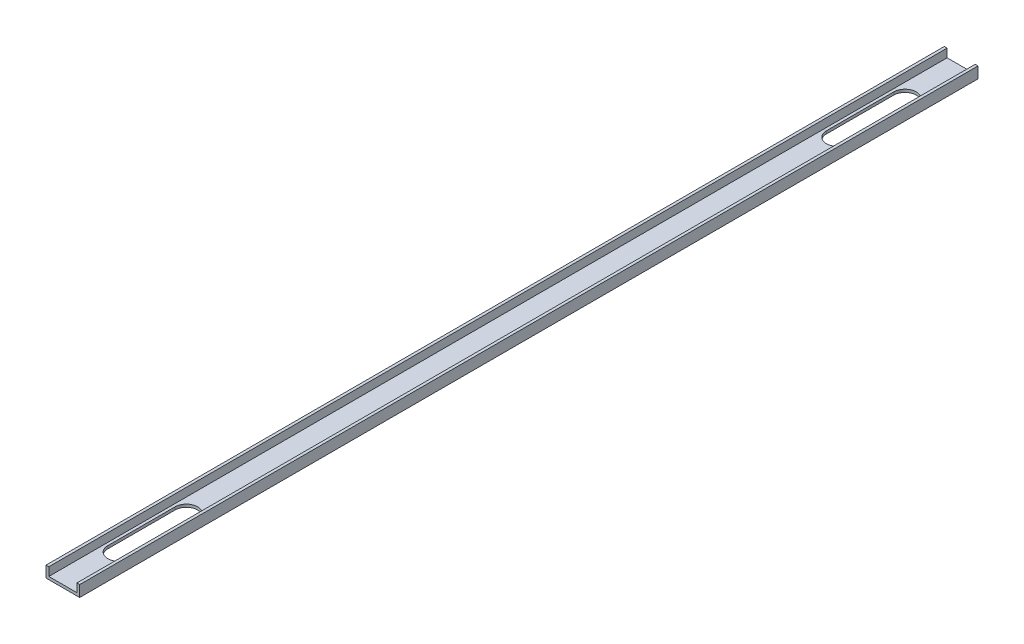
ISO-10303-21;
HEADER;
FILE_DESCRIPTION(('STEP AP214'),'2;1');
FILE_NAME('part.step','',(''),(''),'','','');
FILE_SCHEMA(('AUTOMOTIVE_DESIGN { 1 0 10303 214 1 1 1 1 }'));
ENDSEC;
DATA;
#1=APPLICATION_CONTEXT('core data for automotive mechanical design processes');
#2=APPLICATION_PROTOCOL_DEFINITION('international standard','automotive_design',2000,#1);
#3=PRODUCT_CONTEXT('',#1,'mechanical');
#4=PRODUCT('Part','Part','',(#3));
#5=PRODUCT_RELATED_PRODUCT_CATEGORY('part','',(#4));
#6=PRODUCT_DEFINITION_FORMATION('','',#4);
#7=PRODUCT_DEFINITION_CONTEXT('part definition',#1,'design');
#8=PRODUCT_DEFINITION('design','',#6,#7);
#9=PRODUCT_DEFINITION_SHAPE('','',#8);
#10=(LENGTH_UNIT() NAMED_UNIT(*) SI_UNIT(.MILLI.,.METRE.));
#11=(NAMED_UNIT(*) PLANE_ANGLE_UNIT() SI_UNIT($,.RADIAN.));
#12=(NAMED_UNIT(*) SI_UNIT($,.STERADIAN.) SOLID_ANGLE_UNIT());
#13=UNCERTAINTY_MEASURE_WITH_UNIT(LENGTH_MEASURE(1.E-05),#10,'distance_accuracy_value','');
#14=(GEOMETRIC_REPRESENTATION_CONTEXT(3) GLOBAL_UNCERTAINTY_ASSIGNED_CONTEXT((#13)) GLOBAL_UNIT_ASSIGNED_CONTEXT((#10,
#11,#12)) REPRESENTATION_CONTEXT('',''));
#15=CARTESIAN_POINT('',(0.,0.,0.));
#16=DIRECTION('',(0.,0.,1.));
#17=DIRECTION('',(1.,0.,0.));
#18=AXIS2_PLACEMENT_3D('',#15,#16,#17);
#19=CARTESIAN_POINT('',(0.,0.,1016.));
#20=DIRECTION('',(0.,1.,0.));
#21=DIRECTION('',(0.,0.,1.));
#22=AXIS2_PLACEMENT_3D('',#19,#20,#21);
#23=PLANE('',#22);
#24=DIRECTION('',(1.,0.,0.));
#25=VECTOR('',#24,1.);
#26=CARTESIAN_POINT('',(0.,0.,0.));
#27=LINE('',#26,#25);
#28=CARTESIAN_POINT('',(0.,0.,0.));
#29=VERTEX_POINT('',#28);
#30=CARTESIAN_POINT('',(38.1,0.,0.));
#31=VERTEX_POINT('',#30);
#32=EDGE_CURVE('E245',#29,#31,#27,.T.);
#33=ORIENTED_EDGE('',*,*,#32,.T.);
#34=DIRECTION('',(0.,0.,-1.));
#35=VECTOR('',#34,1.);
#36=CARTESIAN_POINT('',(38.1,0.,1016.));
#37=LINE('',#36,#35);
#38=CARTESIAN_POINT('',(38.1,0.,1016.));
#39=VERTEX_POINT('',#38);
#40=EDGE_CURVE('E48',#39,#31,#37,.T.);
#41=ORIENTED_EDGE('',*,*,#40,.F.);
#42=DIRECTION('',(1.,0.,0.));
#43=VECTOR('',#42,1.);
#44=CARTESIAN_POINT('',(0.,0.,1016.));
#45=LINE('',#44,#43);
#46=CARTESIAN_POINT('',(0.,0.,1016.));
#47=VERTEX_POINT('',#46);
#48=EDGE_CURVE('E227',#47,#39,#45,.T.);
#49=ORIENTED_EDGE('',*,*,#48,.F.);
#50=DIRECTION('',(0.,0.,-1.));
#51=VECTOR('',#50,1.);
#52=CARTESIAN_POINT('',(0.,0.,1016.));
#53=LINE('',#52,#51);
#54=EDGE_CURVE('E11',#47,#29,#53,.T.);
#55=ORIENTED_EDGE('',*,*,#54,.T.);
#56=EDGE_LOOP('',(#33,#41,#49,#55));
#57=FACE_BOUND('',#56,.T.);
#58=DIRECTION('',(0.,0.,-1.));
#59=VECTOR('',#58,1.);
#60=CARTESIAN_POINT('',(6.35,0.,952.5));
#61=LINE('',#60,#59);
#62=CARTESIAN_POINT('',(6.35,0.,952.5));
#63=VERTEX_POINT('',#62);
#64=CARTESIAN_POINT('',(6.35,0.,876.3));
#65=VERTEX_POINT('',#64);
#66=EDGE_CURVE('E194',#63,#65,#61,.T.);
#67=ORIENTED_EDGE('',*,*,#66,.F.);
#68=CARTESIAN_POINT('',(19.05,0.,952.5));
#69=DIRECTION('',(0.,1.,0.));
#70=DIRECTION('',(0.,0.,1.));
#71=AXIS2_PLACEMENT_3D('',#68,#69,#70);
#72=CIRCLE('',#71,12.7);
#73=CARTESIAN_POINT('',(31.75,0.,952.5));
#74=VERTEX_POINT('',#73);
#75=EDGE_CURVE('E197',#74,#63,#72,.F.);
#76=ORIENTED_EDGE('',*,*,#75,.F.);
#77=DIRECTION('',(0.,0.,1.));
#78=VECTOR('',#77,1.);
#79=CARTESIAN_POINT('',(31.75,0.,952.5));
#80=LINE('',#79,#78);
#81=CARTESIAN_POINT('',(31.75,0.,876.3));
#82=VERTEX_POINT('',#81);
#83=EDGE_CURVE('E214',#82,#74,#80,.T.);
#84=ORIENTED_EDGE('',*,*,#83,.F.);
#85=CARTESIAN_POINT('',(19.05,0.,876.3));
#86=DIRECTION('',(0.,1.,0.));
#87=DIRECTION('',(0.,0.,1.));
#88=AXIS2_PLACEMENT_3D('',#85,#86,#87);
#89=CIRCLE('',#88,12.7);
#90=EDGE_CURVE('E162',#65,#82,#89,.F.);
#91=ORIENTED_EDGE('',*,*,#90,.F.);
#92=EDGE_LOOP('',(#67,#76,#84,#91));
#93=FACE_BOUND('',#92,.T.);
#94=CARTESIAN_POINT('',(19.05,0.,63.5));
#95=DIRECTION('',(0.,1.,0.));
#96=DIRECTION('',(0.,0.,1.));
#97=AXIS2_PLACEMENT_3D('',#94,#95,#96);
#98=CIRCLE('',#97,12.7);
#99=CARTESIAN_POINT('',(31.75,0.,63.5));
#100=VERTEX_POINT('',#99);
#101=CARTESIAN_POINT('',(6.35,0.,63.5));
#102=VERTEX_POINT('',#101);
#103=EDGE_CURVE('E166',#100,#102,#98,.T.);
#104=ORIENTED_EDGE('',*,*,#103,.T.);
#105=DIRECTION('',(0.,0.,1.));
#106=VECTOR('',#105,1.);
#107=CARTESIAN_POINT('',(6.35,0.,63.5));
#108=LINE('',#107,#106);
#109=CARTESIAN_POINT('',(6.35,0.,139.7));
#110=VERTEX_POINT('',#109);
#111=EDGE_CURVE('E154',#102,#110,#108,.T.);
#112=ORIENTED_EDGE('',*,*,#111,.T.);
#113=CARTESIAN_POINT('',(19.05,0.,139.7));
#114=DIRECTION('',(0.,1.,0.));
#115=DIRECTION('',(0.,0.,1.));
#116=AXIS2_PLACEMENT_3D('',#113,#114,#115);
#117=CIRCLE('',#116,12.7);
#118=CARTESIAN_POINT('',(31.75,0.,139.7));
#119=VERTEX_POINT('',#118);
#120=EDGE_CURVE('E178',#110,#119,#117,.T.);
#121=ORIENTED_EDGE('',*,*,#120,.T.);
#122=DIRECTION('',(0.,0.,-1.));
#123=VECTOR('',#122,1.);
#124=CARTESIAN_POINT('',(31.75,0.,63.5));
#125=LINE('',#124,#123);
#126=EDGE_CURVE('E172',#119,#100,#125,.T.);
#127=ORIENTED_EDGE('',*,*,#126,.T.);
#128=EDGE_LOOP('',(#104,#112,#121,#127));
#129=FACE_BOUND('',#128,.T.);
#130=ADVANCED_FACE('F39',(#57,#93,#129),#23,.F.);
#131=CARTESIAN_POINT('',(3.175,3.175,1016.));
#132=DIRECTION('',(0.,-1.,0.));
#133=DIRECTION('',(0.,0.,-1.));
#134=AXIS2_PLACEMENT_3D('',#131,#132,#133);
#135=PLANE('',#134);
#136=DIRECTION('',(-1.,0.,0.));
#137=VECTOR('',#136,1.);
#138=CARTESIAN_POINT('',(3.175,3.175,0.));
#139=LINE('',#138,#137);
#140=CARTESIAN_POINT('',(34.925,3.175,0.));
#141=VERTEX_POINT('',#140);
#142=CARTESIAN_POINT('',(3.175,3.175,0.));
#143=VERTEX_POINT('',#142);
#144=EDGE_CURVE('E253',#141,#143,#139,.T.);
#145=ORIENTED_EDGE('',*,*,#144,.T.);
#146=DIRECTION('',(0.,0.,-1.));
#147=VECTOR('',#146,1.);
#148=CARTESIAN_POINT('',(3.175,3.175,1016.));
#149=LINE('',#148,#147);
#150=CARTESIAN_POINT('',(3.175,3.175,1016.));
#151=VERTEX_POINT('',#150);
#152=EDGE_CURVE('E265',#151,#143,#149,.T.);
#153=ORIENTED_EDGE('',*,*,#152,.F.);
#154=DIRECTION('',(-1.,0.,0.));
#155=VECTOR('',#154,1.);
#156=CARTESIAN_POINT('',(3.175,3.175,1016.));
#157=LINE('',#156,#155);
#158=CARTESIAN_POINT('',(34.925,3.175,1016.));
#159=VERTEX_POINT('',#158);
#160=EDGE_CURVE('E236',#159,#151,#157,.T.);
#161=ORIENTED_EDGE('',*,*,#160,.F.);
#162=DIRECTION('',(0.,0.,-1.));
#163=VECTOR('',#162,1.);
#164=CARTESIAN_POINT('',(34.925,3.175,1016.));
#165=LINE('',#164,#163);
#166=EDGE_CURVE('E269',#159,#141,#165,.T.);
#167=ORIENTED_EDGE('',*,*,#166,.T.);
#168=EDGE_LOOP('',(#145,#153,#161,#167));
#169=FACE_BOUND('',#168,.T.);
#170=DIRECTION('',(0.,0.,-1.));
#171=VECTOR('',#170,1.);
#172=CARTESIAN_POINT('',(31.75,3.175,952.5));
#173=LINE('',#172,#171);
#174=CARTESIAN_POINT('',(31.75,3.175,952.5));
#175=VERTEX_POINT('',#174);
#176=CARTESIAN_POINT('',(31.75,3.175,876.3));
#177=VERTEX_POINT('',#176);
#178=EDGE_CURVE('E202',#175,#177,#173,.T.);
#179=ORIENTED_EDGE('',*,*,#178,.F.);
#180=CARTESIAN_POINT('',(19.05,3.175,952.5));
#181=DIRECTION('',(0.,1.,0.));
#182=DIRECTION('',(0.,0.,1.));
#183=AXIS2_PLACEMENT_3D('',#180,#181,#182);
#184=CIRCLE('',#183,12.7);
#185=CARTESIAN_POINT('',(6.35,3.175,952.5));
#186=VERTEX_POINT('',#185);
#187=EDGE_CURVE('E200',#186,#175,#184,.T.);
#188=ORIENTED_EDGE('',*,*,#187,.F.);
#189=DIRECTION('',(0.,0.,1.));
#190=VECTOR('',#189,1.);
#191=CARTESIAN_POINT('',(6.35,3.175,952.5));
#192=LINE('',#191,#190);
#193=CARTESIAN_POINT('',(6.35,3.175,876.3));
#194=VERTEX_POINT('',#193);
#195=EDGE_CURVE('E208',#194,#186,#192,.T.);
#196=ORIENTED_EDGE('',*,*,#195,.F.);
#197=CARTESIAN_POINT('',(19.05,3.175,876.3));
#198=DIRECTION('',(0.,1.,0.));
#199=DIRECTION('',(0.,0.,1.));
#200=AXIS2_PLACEMENT_3D('',#197,#198,#199);
#201=CIRCLE('',#200,12.7);
#202=EDGE_CURVE('E205',#177,#194,#201,.T.);
#203=ORIENTED_EDGE('',*,*,#202,.F.);
#204=EDGE_LOOP('',(#179,#188,#196,#203));
#205=FACE_BOUND('',#204,.T.);
#206=CARTESIAN_POINT('',(19.05,3.175,63.5));
#207=DIRECTION('',(0.,-1.,0.));
#208=DIRECTION('',(0.,0.,-1.));
#209=AXIS2_PLACEMENT_3D('',#206,#207,#208);
#210=CIRCLE('',#209,12.7);
#211=CARTESIAN_POINT('',(6.35,3.175,63.5));
#212=VERTEX_POINT('',#211);
#213=CARTESIAN_POINT('',(31.75,3.175,63.5));
#214=VERTEX_POINT('',#213);
#215=EDGE_CURVE('E65',#212,#214,#210,.T.);
#216=ORIENTED_EDGE('',*,*,#215,.T.);
#217=DIRECTION('',(0.,0.,1.));
#218=VECTOR('',#217,1.);
#219=CARTESIAN_POINT('',(31.75,3.175,63.5));
#220=LINE('',#219,#218);
#221=CARTESIAN_POINT('',(31.75,3.175,139.7));
#222=VERTEX_POINT('',#221);
#223=EDGE_CURVE('E169',#214,#222,#220,.T.);
#224=ORIENTED_EDGE('',*,*,#223,.T.);
#225=CARTESIAN_POINT('',(19.05,3.175,139.7));
#226=DIRECTION('',(0.,-1.,0.));
#227=DIRECTION('',(0.,0.,-1.));
#228=AXIS2_PLACEMENT_3D('',#225,#226,#227);
#229=CIRCLE('',#228,12.7);
#230=CARTESIAN_POINT('',(6.35,3.175,139.7));
#231=VERTEX_POINT('',#230);
#232=EDGE_CURVE('E184',#222,#231,#229,.T.);
#233=ORIENTED_EDGE('',*,*,#232,.T.);
#234=DIRECTION('',(0.,0.,-1.));
#235=VECTOR('',#234,1.);
#236=CARTESIAN_POINT('',(6.35,3.175,63.5));
#237=LINE('',#236,#235);
#238=EDGE_CURVE('E176',#231,#212,#237,.T.);
#239=ORIENTED_EDGE('',*,*,#238,.T.);
#240=EDGE_LOOP('',(#216,#224,#233,#239));
#241=FACE_BOUND('',#240,.T.);
#242=ADVANCED_FACE('F318',(#169,#205,#241),#135,.F.);
#243=CARTESIAN_POINT('',(0.,0.,1016.));
#244=DIRECTION('',(1.,0.,0.));
#245=DIRECTION('',(0.,0.,-1.));
#246=AXIS2_PLACEMENT_3D('',#243,#244,#245);
#247=PLANE('',#246);
#248=DIRECTION('',(0.,-1.,0.));
#249=VECTOR('',#248,1.);
#250=CARTESIAN_POINT('',(0.,0.,0.));
#251=LINE('',#250,#249);
#252=CARTESIAN_POINT('',(0.,12.7,0.));
#253=VERTEX_POINT('',#252);
#254=EDGE_CURVE('E223',#253,#29,#251,.T.);
#255=ORIENTED_EDGE('',*,*,#254,.T.);
#256=ORIENTED_EDGE('',*,*,#54,.F.);
#257=DIRECTION('',(0.,-1.,0.));
#258=VECTOR('',#257,1.);
#259=CARTESIAN_POINT('',(0.,0.,1016.));
#260=LINE('',#259,#258);
#261=CARTESIAN_POINT('',(0.,12.7,1016.));
#262=VERTEX_POINT('',#261);
#263=EDGE_CURVE('E224',#262,#47,#260,.T.);
#264=ORIENTED_EDGE('',*,*,#263,.F.);
#265=DIRECTION('',(0.,0.,-1.));
#266=VECTOR('',#265,1.);
#267=CARTESIAN_POINT('',(0.,12.7,1016.));
#268=LINE('',#267,#266);
#269=EDGE_CURVE('E242',#262,#253,#268,.T.);
#270=ORIENTED_EDGE('',*,*,#269,.T.);
#271=EDGE_LOOP('',(#255,#256,#264,#270));
#272=FACE_BOUND('',#271,.T.);
#273=ADVANCED_FACE('F41',(#272),#247,.F.);
#274=CARTESIAN_POINT('',(38.1,0.,1016.));
#275=DIRECTION('',(-1.,0.,0.));
#276=DIRECTION('',(0.,0.,1.));
#277=AXIS2_PLACEMENT_3D('',#274,#275,#276);
#278=PLANE('',#277);
#279=DIRECTION('',(0.,1.,0.));
#280=VECTOR('',#279,1.);
#281=CARTESIAN_POINT('',(38.1,0.,0.));
#282=LINE('',#281,#280);
#283=CARTESIAN_POINT('',(38.1,12.7,0.));
#284=VERTEX_POINT('',#283);
#285=EDGE_CURVE('E247',#31,#284,#282,.T.);
#286=ORIENTED_EDGE('',*,*,#285,.T.);
#287=DIRECTION('',(0.,0.,-1.));
#288=VECTOR('',#287,1.);
#289=CARTESIAN_POINT('',(38.1,12.7,1016.));
#290=LINE('',#289,#288);
#291=CARTESIAN_POINT('',(38.1,12.7,1016.));
#292=VERTEX_POINT('',#291);
#293=EDGE_CURVE('E275',#292,#284,#290,.T.);
#294=ORIENTED_EDGE('',*,*,#293,.F.);
#295=DIRECTION('',(0.,1.,0.));
#296=VECTOR('',#295,1.);
#297=CARTESIAN_POINT('',(38.1,0.,1016.));
#298=LINE('',#297,#296);
#299=EDGE_CURVE('E230',#39,#292,#298,.T.);
#300=ORIENTED_EDGE('',*,*,#299,.F.);
#301=ORIENTED_EDGE('',*,*,#40,.T.);
#302=EDGE_LOOP('',(#286,#294,#300,#301));
#303=FACE_BOUND('',#302,.T.);
#304=ADVANCED_FACE('F282',(#303),#278,.F.);
#305=CARTESIAN_POINT('',(38.1,12.7,1016.));
#306=DIRECTION('',(0.,-1.,0.));
#307=DIRECTION('',(0.,0.,-1.));
#308=AXIS2_PLACEMENT_3D('',#305,#306,#307);
#309=PLANE('',#308);
#310=DIRECTION('',(-1.,0.,0.));
#311=VECTOR('',#310,1.);
#312=CARTESIAN_POINT('',(38.1,12.7,0.));
#313=LINE('',#312,#311);
#314=CARTESIAN_POINT('',(34.925,12.7,0.));
#315=VERTEX_POINT('',#314);
#316=EDGE_CURVE('E249',#284,#315,#313,.T.);
#317=ORIENTED_EDGE('',*,*,#316,.T.);
#318=DIRECTION('',(0.,0.,-1.));
#319=VECTOR('',#318,1.);
#320=CARTESIAN_POINT('',(34.925,12.7,1016.));
#321=LINE('',#320,#319);
#322=CARTESIAN_POINT('',(34.925,12.7,1016.));
#323=VERTEX_POINT('',#322);
#324=EDGE_CURVE('E272',#323,#315,#321,.T.);
#325=ORIENTED_EDGE('',*,*,#324,.F.);
#326=DIRECTION('',(-1.,0.,0.));
#327=VECTOR('',#326,1.);
#328=CARTESIAN_POINT('',(38.1,12.7,1016.));
#329=LINE('',#328,#327);
#330=EDGE_CURVE('E232',#292,#323,#329,.T.);
#331=ORIENTED_EDGE('',*,*,#330,.F.);
#332=ORIENTED_EDGE('',*,*,#293,.T.);
#333=EDGE_LOOP('',(#317,#325,#331,#332));
#334=FACE_BOUND('',#333,.T.);
#335=ADVANCED_FACE('F293',(#334),#309,.F.);
#336=CARTESIAN_POINT('',(34.925,3.175,1016.));
#337=DIRECTION('',(1.,0.,0.));
#338=DIRECTION('',(0.,0.,-1.));
#339=AXIS2_PLACEMENT_3D('',#336,#337,#338);
#340=PLANE('',#339);
#341=DIRECTION('',(0.,-1.,0.));
#342=VECTOR('',#341,1.);
#343=CARTESIAN_POINT('',(34.925,3.175,0.));
#344=LINE('',#343,#342);
#345=EDGE_CURVE('E251',#315,#141,#344,.T.);
#346=ORIENTED_EDGE('',*,*,#345,.T.);
#347=ORIENTED_EDGE('',*,*,#166,.F.);
#348=DIRECTION('',(0.,-1.,0.));
#349=VECTOR('',#348,1.);
#350=CARTESIAN_POINT('',(34.925,3.175,1016.));
#351=LINE('',#350,#349);
#352=EDGE_CURVE('E234',#323,#159,#351,.T.);
#353=ORIENTED_EDGE('',*,*,#352,.F.);
#354=ORIENTED_EDGE('',*,*,#324,.T.);
#355=EDGE_LOOP('',(#346,#347,#353,#354));
#356=FACE_BOUND('',#355,.T.);
#357=ADVANCED_FACE('F297',(#356),#340,.F.);
#358=CARTESIAN_POINT('',(3.175,3.175,1016.));
#359=DIRECTION('',(-1.,0.,0.));
#360=DIRECTION('',(0.,0.,1.));
#361=AXIS2_PLACEMENT_3D('',#358,#359,#360);
#362=PLANE('',#361);
#363=DIRECTION('',(0.,1.,0.));
#364=VECTOR('',#363,1.);
#365=CARTESIAN_POINT('',(3.175,3.175,0.));
#366=LINE('',#365,#364);
#367=CARTESIAN_POINT('',(3.175,12.7,0.));
#368=VERTEX_POINT('',#367);
#369=EDGE_CURVE('E255',#143,#368,#366,.T.);
#370=ORIENTED_EDGE('',*,*,#369,.T.);
#371=DIRECTION('',(0.,0.,-1.));
#372=VECTOR('',#371,1.);
#373=CARTESIAN_POINT('',(3.175,12.7,1016.));
#374=LINE('',#373,#372);
#375=CARTESIAN_POINT('',(3.175,12.7,1016.));
#376=VERTEX_POINT('',#375);
#377=EDGE_CURVE('E261',#376,#368,#374,.T.);
#378=ORIENTED_EDGE('',*,*,#377,.F.);
#379=DIRECTION('',(0.,1.,0.));
#380=VECTOR('',#379,1.);
#381=CARTESIAN_POINT('',(3.175,3.175,1016.));
#382=LINE('',#381,#380);
#383=EDGE_CURVE('E238',#151,#376,#382,.T.);
#384=ORIENTED_EDGE('',*,*,#383,.F.);
#385=ORIENTED_EDGE('',*,*,#152,.T.);
#386=EDGE_LOOP('',(#370,#378,#384,#385));
#387=FACE_BOUND('',#386,.T.);
#388=ADVANCED_FACE('F316',(#387),#362,.F.);
#389=CARTESIAN_POINT('',(0.,12.7,1016.));
#390=DIRECTION('',(0.,-1.,0.));
#391=DIRECTION('',(0.,0.,-1.));
#392=AXIS2_PLACEMENT_3D('',#389,#390,#391);
#393=PLANE('',#392);
#394=DIRECTION('',(-1.,0.,0.));
#395=VECTOR('',#394,1.);
#396=CARTESIAN_POINT('',(0.,12.7,0.));
#397=LINE('',#396,#395);
#398=EDGE_CURVE('E228',#368,#253,#397,.T.);
#399=ORIENTED_EDGE('',*,*,#398,.T.);
#400=ORIENTED_EDGE('',*,*,#269,.F.);
#401=DIRECTION('',(-1.,0.,0.));
#402=VECTOR('',#401,1.);
#403=CARTESIAN_POINT('',(0.,12.7,1016.));
#404=LINE('',#403,#402);
#405=EDGE_CURVE('E240',#376,#262,#404,.T.);
#406=ORIENTED_EDGE('',*,*,#405,.F.);
#407=ORIENTED_EDGE('',*,*,#377,.T.);
#408=EDGE_LOOP('',(#399,#400,#406,#407));
#409=FACE_BOUND('',#408,.T.);
#410=ADVANCED_FACE('F311',(#409),#393,.F.);
#411=CARTESIAN_POINT('',(0.,0.,1016.));
#412=DIRECTION('',(0.,0.,-1.));
#413=DIRECTION('',(-1.,0.,0.));
#414=AXIS2_PLACEMENT_3D('',#411,#412,#413);
#415=PLANE('',#414);
#416=ORIENTED_EDGE('',*,*,#263,.T.);
#417=ORIENTED_EDGE('',*,*,#48,.T.);
#418=ORIENTED_EDGE('',*,*,#299,.T.);
#419=ORIENTED_EDGE('',*,*,#330,.T.);
#420=ORIENTED_EDGE('',*,*,#352,.T.);
#421=ORIENTED_EDGE('',*,*,#160,.T.);
#422=ORIENTED_EDGE('',*,*,#383,.T.);
#423=ORIENTED_EDGE('',*,*,#405,.T.);
#424=EDGE_LOOP('',(#416,#417,#418,#419,#420,#421,#422,#423));
#425=FACE_BOUND('',#424,.T.);
#426=ADVANCED_FACE('F301',(#425),#415,.F.);
#427=CARTESIAN_POINT('',(0.,0.,0.));
#428=DIRECTION('',(0.,0.,-1.));
#429=DIRECTION('',(-1.,0.,0.));
#430=AXIS2_PLACEMENT_3D('',#427,#428,#429);
#431=PLANE('',#430);
#432=ORIENTED_EDGE('',*,*,#254,.F.);
#433=ORIENTED_EDGE('',*,*,#398,.F.);
#434=ORIENTED_EDGE('',*,*,#369,.F.);
#435=ORIENTED_EDGE('',*,*,#144,.F.);
#436=ORIENTED_EDGE('',*,*,#345,.F.);
#437=ORIENTED_EDGE('',*,*,#316,.F.);
#438=ORIENTED_EDGE('',*,*,#285,.F.);
#439=ORIENTED_EDGE('',*,*,#32,.F.);
#440=EDGE_LOOP('',(#432,#433,#434,#435,#436,#437,#438,#439));
#441=FACE_BOUND('',#440,.T.);
#442=ADVANCED_FACE('F288',(#441),#431,.T.);
#443=CARTESIAN_POINT('',(19.05,-0.00100000000000013,952.5));
#444=DIRECTION('',(0.,1.,0.));
#445=DIRECTION('',(0.,0.,1.));
#446=AXIS2_PLACEMENT_3D('',#443,#444,#445);
#447=CYLINDRICAL_SURFACE('',#446,12.7);
#448=ORIENTED_EDGE('',*,*,#75,.T.);
#449=DIRECTION('',(0.,1.,0.));
#450=VECTOR('',#449,1.);
#451=CARTESIAN_POINT('',(6.35,-0.00100000000000013,952.5));
#452=LINE('',#451,#450);
#453=EDGE_CURVE('E212',#63,#186,#452,.T.);
#454=ORIENTED_EDGE('',*,*,#453,.T.);
#455=ORIENTED_EDGE('',*,*,#187,.T.);
#456=DIRECTION('',(0.,1.,0.));
#457=VECTOR('',#456,1.);
#458=CARTESIAN_POINT('',(31.75,-0.00100000000000013,952.5));
#459=LINE('',#458,#457);
#460=EDGE_CURVE('E211',#74,#175,#459,.T.);
#461=ORIENTED_EDGE('',*,*,#460,.F.);
#462=EDGE_LOOP('',(#448,#454,#455,#461));
#463=FACE_BOUND('',#462,.T.);
#464=ADVANCED_FACE('F358',(#463),#447,.F.);
#465=CARTESIAN_POINT('',(6.35,-0.00100000000000013,952.5));
#466=DIRECTION('',(-1.,0.,0.));
#467=DIRECTION('',(0.,0.,1.));
#468=AXIS2_PLACEMENT_3D('',#465,#466,#467);
#469=PLANE('',#468);
#470=ORIENTED_EDGE('',*,*,#66,.T.);
#471=DIRECTION('',(0.,1.,0.));
#472=VECTOR('',#471,1.);
#473=CARTESIAN_POINT('',(6.35,-0.00100000000000013,876.3));
#474=LINE('',#473,#472);
#475=EDGE_CURVE('E215',#65,#194,#474,.T.);
#476=ORIENTED_EDGE('',*,*,#475,.T.);
#477=ORIENTED_EDGE('',*,*,#195,.T.);
#478=ORIENTED_EDGE('',*,*,#453,.F.);
#479=EDGE_LOOP('',(#470,#476,#477,#478));
#480=FACE_BOUND('',#479,.T.);
#481=ADVANCED_FACE('F363',(#480),#469,.F.);
#482=CARTESIAN_POINT('',(19.05,-0.00100000000000013,876.3));
#483=DIRECTION('',(0.,1.,0.));
#484=DIRECTION('',(0.,0.,1.));
#485=AXIS2_PLACEMENT_3D('',#482,#483,#484);
#486=CYLINDRICAL_SURFACE('',#485,12.7);
#487=ORIENTED_EDGE('',*,*,#90,.T.);
#488=DIRECTION('',(0.,1.,0.));
#489=VECTOR('',#488,1.);
#490=CARTESIAN_POINT('',(31.75,-0.00100000000000013,876.3));
#491=LINE('',#490,#489);
#492=EDGE_CURVE('E217',#82,#177,#491,.T.);
#493=ORIENTED_EDGE('',*,*,#492,.T.);
#494=ORIENTED_EDGE('',*,*,#202,.T.);
#495=ORIENTED_EDGE('',*,*,#475,.F.);
#496=EDGE_LOOP('',(#487,#493,#494,#495));
#497=FACE_BOUND('',#496,.T.);
#498=ADVANCED_FACE('F367',(#497),#486,.F.);
#499=CARTESIAN_POINT('',(31.75,-0.00100000000000013,952.5));
#500=DIRECTION('',(1.,0.,0.));
#501=DIRECTION('',(0.,0.,-1.));
#502=AXIS2_PLACEMENT_3D('',#499,#500,#501);
#503=PLANE('',#502);
#504=ORIENTED_EDGE('',*,*,#83,.T.);
#505=ORIENTED_EDGE('',*,*,#460,.T.);
#506=ORIENTED_EDGE('',*,*,#178,.T.);
#507=ORIENTED_EDGE('',*,*,#492,.F.);
#508=EDGE_LOOP('',(#504,#505,#506,#507));
#509=FACE_BOUND('',#508,.T.);
#510=ADVANCED_FACE('F340',(#509),#503,.F.);
#511=CARTESIAN_POINT('',(19.05,-0.00100000000000013,63.5));
#512=DIRECTION('',(0.,1.,0.));
#513=DIRECTION('',(0.,0.,1.));
#514=AXIS2_PLACEMENT_3D('',#511,#512,#513);
#515=CYLINDRICAL_SURFACE('',#514,12.7);
#516=DIRECTION('',(0.,1.,0.));
#517=VECTOR('',#516,1.);
#518=CARTESIAN_POINT('',(31.75,-0.00100000000000013,63.5));
#519=LINE('',#518,#517);
#520=EDGE_CURVE('E163',#100,#214,#519,.T.);
#521=ORIENTED_EDGE('',*,*,#520,.T.);
#522=ORIENTED_EDGE('',*,*,#215,.F.);
#523=DIRECTION('',(0.,1.,0.));
#524=VECTOR('',#523,1.);
#525=CARTESIAN_POINT('',(6.35,-0.00100000000000013,63.5));
#526=LINE('',#525,#524);
#527=EDGE_CURVE('E156',#102,#212,#526,.T.);
#528=ORIENTED_EDGE('',*,*,#527,.F.);
#529=ORIENTED_EDGE('',*,*,#103,.F.);
#530=EDGE_LOOP('',(#521,#522,#528,#529));
#531=FACE_BOUND('',#530,.T.);
#532=ADVANCED_FACE('F165',(#531),#515,.F.);
#533=CARTESIAN_POINT('',(31.75,-0.00100000000000013,63.5));
#534=DIRECTION('',(-1.,0.,0.));
#535=DIRECTION('',(0.,0.,1.));
#536=AXIS2_PLACEMENT_3D('',#533,#534,#535);
#537=PLANE('',#536);
#538=DIRECTION('',(0.,1.,0.));
#539=VECTOR('',#538,1.);
#540=CARTESIAN_POINT('',(31.75,-0.00100000000000013,139.7));
#541=LINE('',#540,#539);
#542=EDGE_CURVE('E190',#119,#222,#541,.T.);
#543=ORIENTED_EDGE('',*,*,#542,.T.);
#544=ORIENTED_EDGE('',*,*,#223,.F.);
#545=ORIENTED_EDGE('',*,*,#520,.F.);
#546=ORIENTED_EDGE('',*,*,#126,.F.);
#547=EDGE_LOOP('',(#543,#544,#545,#546));
#548=FACE_BOUND('',#547,.T.);
#549=ADVANCED_FACE('F332',(#548),#537,.T.);
#550=CARTESIAN_POINT('',(19.05,-0.00100000000000013,139.7));
#551=DIRECTION('',(0.,1.,0.));
#552=DIRECTION('',(0.,0.,1.));
#553=AXIS2_PLACEMENT_3D('',#550,#551,#552);
#554=CYLINDRICAL_SURFACE('',#553,12.7);
#555=DIRECTION('',(0.,1.,0.));
#556=VECTOR('',#555,1.);
#557=CARTESIAN_POINT('',(6.35,-0.00100000000000013,139.7));
#558=LINE('',#557,#556);
#559=EDGE_CURVE('E55',#110,#231,#558,.T.);
#560=ORIENTED_EDGE('',*,*,#559,.T.);
#561=ORIENTED_EDGE('',*,*,#232,.F.);
#562=ORIENTED_EDGE('',*,*,#542,.F.);
#563=ORIENTED_EDGE('',*,*,#120,.F.);
#564=EDGE_LOOP('',(#560,#561,#562,#563));
#565=FACE_BOUND('',#564,.T.);
#566=ADVANCED_FACE('F330',(#565),#554,.F.);
#567=CARTESIAN_POINT('',(6.35,-0.00100000000000013,63.5));
#568=DIRECTION('',(1.,0.,0.));
#569=DIRECTION('',(0.,0.,-1.));
#570=AXIS2_PLACEMENT_3D('',#567,#568,#569);
#571=PLANE('',#570);
#572=ORIENTED_EDGE('',*,*,#527,.T.);
#573=ORIENTED_EDGE('',*,*,#238,.F.);
#574=ORIENTED_EDGE('',*,*,#559,.F.);
#575=ORIENTED_EDGE('',*,*,#111,.F.);
#576=EDGE_LOOP('',(#572,#573,#574,#575));
#577=FACE_BOUND('',#576,.T.);
#578=ADVANCED_FACE('F155',(#577),#571,.T.);
#579=CLOSED_SHELL('',(#130,#242,#273,#304,#335,#357,#388,#410,#426,#442,#464,#481,#498,#510,
#532,#549,#566,#578));
#580=MANIFOLD_SOLID_BREP('B2',#579);
#581=ADVANCED_BREP_SHAPE_REPRESENTATION('',(#18,#580),#14);
#582=SHAPE_DEFINITION_REPRESENTATION(#9,#581);
ENDSEC;
END-ISO-10303-21;
